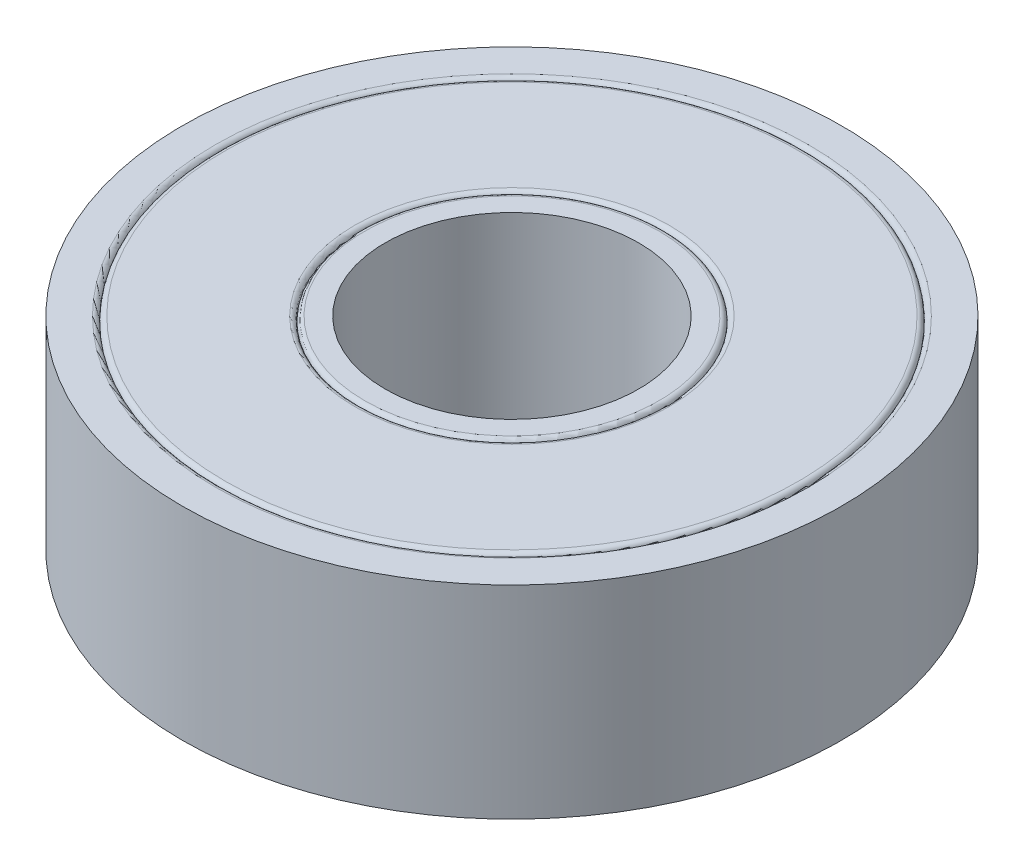
ISO-10303-21;
HEADER;
FILE_DESCRIPTION(('STEP AP214'),'2;1');
FILE_NAME('part.step','',(''),(''),'','','');
FILE_SCHEMA(('AUTOMOTIVE_DESIGN { 1 0 10303 214 1 1 1 1 }'));
ENDSEC;
DATA;
#1=APPLICATION_CONTEXT('core data for automotive mechanical design processes');
#2=APPLICATION_PROTOCOL_DEFINITION('international standard','automotive_design',2000,#1);
#3=PRODUCT_CONTEXT('',#1,'mechanical');
#4=PRODUCT('Part','Part','',(#3));
#5=PRODUCT_RELATED_PRODUCT_CATEGORY('part','',(#4));
#6=PRODUCT_DEFINITION_FORMATION('','',#4);
#7=PRODUCT_DEFINITION_CONTEXT('part definition',#1,'design');
#8=PRODUCT_DEFINITION('design','',#6,#7);
#9=PRODUCT_DEFINITION_SHAPE('','',#8);
#10=(LENGTH_UNIT() NAMED_UNIT(*) SI_UNIT(.MILLI.,.METRE.));
#11=(NAMED_UNIT(*) PLANE_ANGLE_UNIT() SI_UNIT($,.RADIAN.));
#12=(NAMED_UNIT(*) SI_UNIT($,.STERADIAN.) SOLID_ANGLE_UNIT());
#13=UNCERTAINTY_MEASURE_WITH_UNIT(LENGTH_MEASURE(1.E-05),#10,'distance_accuracy_value','');
#14=(GEOMETRIC_REPRESENTATION_CONTEXT(3) GLOBAL_UNCERTAINTY_ASSIGNED_CONTEXT((#13)) GLOBAL_UNIT_ASSIGNED_CONTEXT((#10,
#11,#12)) REPRESENTATION_CONTEXT('',''));
#15=CARTESIAN_POINT('',(0.,0.,0.));
#16=DIRECTION('',(0.,0.,1.));
#17=DIRECTION('',(1.,0.,0.));
#18=AXIS2_PLACEMENT_3D('',#15,#16,#17);
#19=CARTESIAN_POINT('',(-6.70288887729105,-2.,-5.62439158475723));
#20=DIRECTION('',(0.,1.,0.));
#21=DIRECTION('',(0.,0.,1.));
#22=AXIS2_PLACEMENT_3D('',#19,#20,#21);
#23=CYLINDRICAL_SURFACE('',#22,2.75);
#24=CARTESIAN_POINT('',(-6.70288887729105,7.,-5.62439158475723));
#25=DIRECTION('',(0.,1.,0.));
#26=DIRECTION('',(0.,0.,1.));
#27=AXIS2_PLACEMENT_3D('',#24,#25,#26);
#28=CIRCLE('',#27,2.75);
#29=CARTESIAN_POINT('',(-6.70288887729105,7.,-2.87439158475723));
#30=VERTEX_POINT('',#29);
#31=EDGE_CURVE('E243',#30,#30,#28,.F.);
#32=ORIENTED_EDGE('',*,*,#31,.T.);
#33=EDGE_LOOP('',(#32));
#34=FACE_BOUND('',#33,.T.);
#35=CARTESIAN_POINT('',(-6.70288887729105,1.,-5.62439158475723));
#36=DIRECTION('',(0.,-1.,0.));
#37=DIRECTION('',(0.,0.,-1.));
#38=AXIS2_PLACEMENT_3D('',#35,#36,#37);
#39=CIRCLE('',#38,2.75);
#40=CARTESIAN_POINT('',(-6.70288887729105,1.,-8.37439158475723));
#41=VERTEX_POINT('',#40);
#42=EDGE_CURVE('E12',#41,#41,#39,.F.);
#43=ORIENTED_EDGE('',*,*,#42,.T.);
#44=EDGE_LOOP('',(#43));
#45=FACE_BOUND('',#44,.T.);
#46=ADVANCED_FACE('F237',(#34,#45),#23,.T.);
#47=CARTESIAN_POINT('',(0.,7.,0.));
#48=DIRECTION('',(0.,1.,0.));
#49=DIRECTION('',(0.,0.,1.));
#50=AXIS2_PLACEMENT_3D('',#47,#48,#49);
#51=PLANE('',#50);
#52=ORIENTED_EDGE('',*,*,#31,.F.);
#53=EDGE_LOOP('',(#52));
#54=FACE_BOUND('',#53,.T.);
#55=ADVANCED_FACE('F250',(#54),#51,.T.);
#56=CARTESIAN_POINT('',(0.,1.,0.));
#57=DIRECTION('',(0.,-1.,0.));
#58=DIRECTION('',(0.,0.,-1.));
#59=AXIS2_PLACEMENT_3D('',#56,#57,#58);
#60=PLANE('',#59);
#61=ORIENTED_EDGE('',*,*,#42,.F.);
#62=EDGE_LOOP('',(#61));
#63=FACE_BOUND('',#62,.T.);
#64=ADVANCED_FACE('F252',(#63),#60,.T.);
#65=CLOSED_SHELL('',(#46,#55,#64));
#66=MANIFOLD_SOLID_BREP('B2',#65);
#67=CARTESIAN_POINT('',(0.,8.,0.));
#68=DIRECTION('',(0.,-1.,0.));
#69=DIRECTION('',(0.,0.,-1.));
#70=AXIS2_PLACEMENT_3D('',#67,#68,#69);
#71=CYLINDRICAL_SURFACE('',#70,13.);
#72=CARTESIAN_POINT('',(0.,8.,0.));
#73=DIRECTION('',(0.,1.,0.));
#74=DIRECTION('',(0.,0.,1.));
#75=AXIS2_PLACEMENT_3D('',#72,#73,#74);
#76=CIRCLE('',#75,13.);
#77=CARTESIAN_POINT('',(0.,8.,13.));
#78=VERTEX_POINT('',#77);
#79=EDGE_CURVE('E337',#78,#78,#76,.T.);
#80=ORIENTED_EDGE('',*,*,#79,.F.);
#81=EDGE_LOOP('',(#80));
#82=FACE_BOUND('',#81,.T.);
#83=CARTESIAN_POINT('',(0.,0.,0.));
#84=DIRECTION('',(0.,1.,0.));
#85=DIRECTION('',(0.,0.,1.));
#86=AXIS2_PLACEMENT_3D('',#83,#84,#85);
#87=CIRCLE('',#86,13.);
#88=CARTESIAN_POINT('',(0.,0.,13.));
#89=VERTEX_POINT('',#88);
#90=EDGE_CURVE('E340',#89,#89,#87,.T.);
#91=ORIENTED_EDGE('',*,*,#90,.T.);
#92=EDGE_LOOP('',(#91));
#93=FACE_BOUND('',#92,.T.);
#94=ADVANCED_FACE('F289',(#82,#93),#71,.T.);
#95=CARTESIAN_POINT('',(0.,0.,0.));
#96=DIRECTION('',(0.,1.,0.));
#97=DIRECTION('',(0.,0.,1.));
#98=AXIS2_PLACEMENT_3D('',#95,#96,#97);
#99=PLANE('',#98);
#100=CARTESIAN_POINT('',(0.,0.,0.));
#101=DIRECTION('',(0.,1.,0.));
#102=DIRECTION('',(0.,0.,1.));
#103=AXIS2_PLACEMENT_3D('',#100,#101,#102);
#104=CIRCLE('',#103,11.7);
#105=CARTESIAN_POINT('',(0.,0.,11.7));
#106=VERTEX_POINT('',#105);
#107=EDGE_CURVE('E316',#106,#106,#104,.T.);
#108=ORIENTED_EDGE('',*,*,#107,.T.);
#109=EDGE_LOOP('',(#108));
#110=FACE_BOUND('',#109,.T.);
#111=ORIENTED_EDGE('',*,*,#90,.F.);
#112=EDGE_LOOP('',(#111));
#113=FACE_BOUND('',#112,.T.);
#114=ADVANCED_FACE('F390',(#110,#113),#99,.F.);
#115=CARTESIAN_POINT('',(0.,8.,0.));
#116=DIRECTION('',(0.,1.,0.));
#117=DIRECTION('',(0.,0.,1.));
#118=AXIS2_PLACEMENT_3D('',#115,#116,#117);
#119=PLANE('',#118);
#120=CARTESIAN_POINT('',(0.,8.,0.));
#121=DIRECTION('',(0.,1.,0.));
#122=DIRECTION('',(0.,0.,1.));
#123=AXIS2_PLACEMENT_3D('',#120,#121,#122);
#124=CIRCLE('',#123,11.7);
#125=CARTESIAN_POINT('',(0.,8.,11.7));
#126=VERTEX_POINT('',#125);
#127=EDGE_CURVE('E331',#126,#126,#124,.F.);
#128=ORIENTED_EDGE('',*,*,#127,.T.);
#129=EDGE_LOOP('',(#128));
#130=FACE_BOUND('',#129,.T.);
#131=ORIENTED_EDGE('',*,*,#79,.T.);
#132=EDGE_LOOP('',(#131));
#133=FACE_BOUND('',#132,.T.);
#134=ADVANCED_FACE('F393',(#130,#133),#119,.T.);
#135=CARTESIAN_POINT('',(0.,7.8,0.));
#136=DIRECTION('',(0.,1.,0.));
#137=DIRECTION('',(0.,0.,1.));
#138=AXIS2_PLACEMENT_3D('',#135,#136,#137);
#139=TOROIDAL_SURFACE('',#138,11.7,0.2);
#140=ORIENTED_EDGE('',*,*,#127,.F.);
#141=EDGE_LOOP('',(#140));
#142=FACE_BOUND('',#141,.T.);
#143=CARTESIAN_POINT('',(0.,7.8,0.));
#144=DIRECTION('',(0.,1.,0.));
#145=DIRECTION('',(0.,0.,1.));
#146=AXIS2_PLACEMENT_3D('',#143,#144,#145);
#147=CIRCLE('',#146,11.5);
#148=CARTESIAN_POINT('',(0.,7.8,11.5));
#149=VERTEX_POINT('',#148);
#150=EDGE_CURVE('E334',#149,#149,#147,.T.);
#151=ORIENTED_EDGE('',*,*,#150,.F.);
#152=EDGE_LOOP('',(#151));
#153=FACE_BOUND('',#152,.T.);
#154=ADVANCED_FACE('F397',(#142,#153),#139,.T.);
#155=CARTESIAN_POINT('',(0.,8.,0.));
#156=DIRECTION('',(0.,1.,0.));
#157=DIRECTION('',(0.,0.,1.));
#158=AXIS2_PLACEMENT_3D('',#155,#156,#157);
#159=PLANE('',#158);
#160=CARTESIAN_POINT('',(0.,8.,0.));
#161=DIRECTION('',(0.,1.,0.));
#162=DIRECTION('',(0.,0.,1.));
#163=AXIS2_PLACEMENT_3D('',#160,#161,#162);
#164=CIRCLE('',#163,11.3);
#165=CARTESIAN_POINT('',(0.,8.,11.3));
#166=VERTEX_POINT('',#165);
#167=EDGE_CURVE('E236',#166,#166,#164,.T.);
#168=ORIENTED_EDGE('',*,*,#167,.T.);
#169=EDGE_LOOP('',(#168));
#170=FACE_BOUND('',#169,.T.);
#171=CARTESIAN_POINT('',(0.,8.,0.));
#172=DIRECTION('',(0.,1.,0.));
#173=DIRECTION('',(0.,0.,1.));
#174=AXIS2_PLACEMENT_3D('',#171,#172,#173);
#175=CIRCLE('',#174,6.2);
#176=CARTESIAN_POINT('',(0.,8.,6.2));
#177=VERTEX_POINT('',#176);
#178=EDGE_CURVE('E297',#177,#177,#175,.F.);
#179=ORIENTED_EDGE('',*,*,#178,.T.);
#180=EDGE_LOOP('',(#179));
#181=FACE_BOUND('',#180,.T.);
#182=ADVANCED_FACE('F401',(#170,#181),#159,.T.);
#183=CARTESIAN_POINT('',(0.,8.,0.));
#184=DIRECTION('',(0.,1.,0.));
#185=DIRECTION('',(0.,0.,1.));
#186=AXIS2_PLACEMENT_3D('',#183,#184,#185);
#187=PLANE('',#186);
#188=CARTESIAN_POINT('',(0.,8.,0.));
#189=DIRECTION('',(0.,1.,0.));
#190=DIRECTION('',(0.,0.,1.));
#191=AXIS2_PLACEMENT_3D('',#188,#189,#190);
#192=CIRCLE('',#191,5.8);
#193=CARTESIAN_POINT('',(0.,8.,5.8));
#194=VERTEX_POINT('',#193);
#195=EDGE_CURVE('E346',#194,#194,#192,.T.);
#196=ORIENTED_EDGE('',*,*,#195,.T.);
#197=EDGE_LOOP('',(#196));
#198=FACE_BOUND('',#197,.T.);
#199=CARTESIAN_POINT('',(0.,8.,0.));
#200=DIRECTION('',(0.,1.,0.));
#201=DIRECTION('',(0.,0.,1.));
#202=AXIS2_PLACEMENT_3D('',#199,#200,#201);
#203=CIRCLE('',#202,5.);
#204=CARTESIAN_POINT('',(0.,8.,5.));
#205=VERTEX_POINT('',#204);
#206=EDGE_CURVE('E349',#205,#205,#203,.T.);
#207=ORIENTED_EDGE('',*,*,#206,.F.);
#208=EDGE_LOOP('',(#207));
#209=FACE_BOUND('',#208,.T.);
#210=ADVANCED_FACE('F457',(#198,#209),#187,.T.);
#211=CARTESIAN_POINT('',(0.,0.,0.));
#212=DIRECTION('',(0.,1.,0.));
#213=DIRECTION('',(0.,0.,1.));
#214=AXIS2_PLACEMENT_3D('',#211,#212,#213);
#215=PLANE('',#214);
#216=CARTESIAN_POINT('',(0.,0.,0.));
#217=DIRECTION('',(0.,1.,0.));
#218=DIRECTION('',(0.,0.,1.));
#219=AXIS2_PLACEMENT_3D('',#216,#217,#218);
#220=CIRCLE('',#219,5.8);
#221=CARTESIAN_POINT('',(0.,0.,5.8));
#222=VERTEX_POINT('',#221);
#223=EDGE_CURVE('E319',#222,#222,#220,.F.);
#224=ORIENTED_EDGE('',*,*,#223,.T.);
#225=EDGE_LOOP('',(#224));
#226=FACE_BOUND('',#225,.T.);
#227=CARTESIAN_POINT('',(0.,0.,0.));
#228=DIRECTION('',(0.,1.,0.));
#229=DIRECTION('',(0.,0.,1.));
#230=AXIS2_PLACEMENT_3D('',#227,#228,#229);
#231=CIRCLE('',#230,5.);
#232=CARTESIAN_POINT('',(0.,0.,5.));
#233=VERTEX_POINT('',#232);
#234=EDGE_CURVE('E352',#233,#233,#231,.T.);
#235=ORIENTED_EDGE('',*,*,#234,.T.);
#236=EDGE_LOOP('',(#235));
#237=FACE_BOUND('',#236,.T.);
#238=ADVANCED_FACE('F464',(#226,#237),#215,.F.);
#239=CARTESIAN_POINT('',(0.,8.,0.));
#240=DIRECTION('',(0.,-1.,0.));
#241=DIRECTION('',(0.,0.,-1.));
#242=AXIS2_PLACEMENT_3D('',#239,#240,#241);
#243=CYLINDRICAL_SURFACE('',#242,5.);
#244=ORIENTED_EDGE('',*,*,#206,.T.);
#245=EDGE_LOOP('',(#244));
#246=FACE_BOUND('',#245,.T.);
#247=ORIENTED_EDGE('',*,*,#234,.F.);
#248=EDGE_LOOP('',(#247));
#249=FACE_BOUND('',#248,.T.);
#250=ADVANCED_FACE('F473',(#246,#249),#243,.F.);
#251=CARTESIAN_POINT('',(0.,7.8,0.));
#252=DIRECTION('',(0.,1.,0.));
#253=DIRECTION('',(0.,0.,1.));
#254=AXIS2_PLACEMENT_3D('',#251,#252,#253);
#255=TOROIDAL_SURFACE('',#254,5.8,0.2);
#256=CARTESIAN_POINT('',(0.,7.8,0.));
#257=DIRECTION('',(0.,1.,0.));
#258=DIRECTION('',(0.,0.,1.));
#259=AXIS2_PLACEMENT_3D('',#256,#257,#258);
#260=CIRCLE('',#259,6.);
#261=CARTESIAN_POINT('',(0.,7.8,6.));
#262=VERTEX_POINT('',#261);
#263=EDGE_CURVE('E325',#262,#262,#260,.T.);
#264=ORIENTED_EDGE('',*,*,#263,.T.);
#265=EDGE_LOOP('',(#264));
#266=FACE_BOUND('',#265,.T.);
#267=ORIENTED_EDGE('',*,*,#195,.F.);
#268=EDGE_LOOP('',(#267));
#269=FACE_BOUND('',#268,.T.);
#270=ADVANCED_FACE('F407',(#266,#269),#255,.T.);
#271=CARTESIAN_POINT('',(0.,0.2,0.));
#272=DIRECTION('',(0.,1.,0.));
#273=DIRECTION('',(0.,0.,1.));
#274=AXIS2_PLACEMENT_3D('',#271,#272,#273);
#275=TOROIDAL_SURFACE('',#274,5.8,0.2);
#276=ORIENTED_EDGE('',*,*,#223,.F.);
#277=EDGE_LOOP('',(#276));
#278=FACE_BOUND('',#277,.T.);
#279=CARTESIAN_POINT('',(0.,0.2,0.));
#280=DIRECTION('',(0.,1.,0.));
#281=DIRECTION('',(0.,0.,1.));
#282=AXIS2_PLACEMENT_3D('',#279,#280,#281);
#283=CIRCLE('',#282,6.);
#284=CARTESIAN_POINT('',(0.,0.2,6.));
#285=VERTEX_POINT('',#284);
#286=EDGE_CURVE('E322',#285,#285,#283,.T.);
#287=ORIENTED_EDGE('',*,*,#286,.F.);
#288=EDGE_LOOP('',(#287));
#289=FACE_BOUND('',#288,.T.);
#290=ADVANCED_FACE('F403',(#278,#289),#275,.T.);
#291=CARTESIAN_POINT('',(0.,0.2,0.));
#292=DIRECTION('',(0.,1.,0.));
#293=DIRECTION('',(0.,0.,1.));
#294=AXIS2_PLACEMENT_3D('',#291,#292,#293);
#295=TOROIDAL_SURFACE('',#294,11.7,0.2);
#296=CARTESIAN_POINT('',(0.,0.2,0.));
#297=DIRECTION('',(0.,1.,0.));
#298=DIRECTION('',(0.,0.,1.));
#299=AXIS2_PLACEMENT_3D('',#296,#297,#298);
#300=CIRCLE('',#299,11.5);
#301=CARTESIAN_POINT('',(0.,0.2,11.5));
#302=VERTEX_POINT('',#301);
#303=EDGE_CURVE('E313',#302,#302,#300,.F.);
#304=ORIENTED_EDGE('',*,*,#303,.F.);
#305=EDGE_LOOP('',(#304));
#306=FACE_BOUND('',#305,.T.);
#307=ORIENTED_EDGE('',*,*,#107,.F.);
#308=EDGE_LOOP('',(#307));
#309=FACE_BOUND('',#308,.T.);
#310=ADVANCED_FACE('F406',(#306,#309),#295,.T.);
#311=CARTESIAN_POINT('',(0.,0.,0.));
#312=DIRECTION('',(0.,-1.,0.));
#313=DIRECTION('',(0.,0.,-1.));
#314=AXIS2_PLACEMENT_3D('',#311,#312,#313);
#315=PLANE('',#314);
#316=CARTESIAN_POINT('',(0.,0.,0.));
#317=DIRECTION('',(0.,-1.,0.));
#318=DIRECTION('',(0.,0.,-1.));
#319=AXIS2_PLACEMENT_3D('',#316,#317,#318);
#320=CIRCLE('',#319,6.2);
#321=CARTESIAN_POINT('',(0.,0.,-6.2));
#322=VERTEX_POINT('',#321);
#323=EDGE_CURVE('E301',#322,#322,#320,.F.);
#324=ORIENTED_EDGE('',*,*,#323,.T.);
#325=EDGE_LOOP('',(#324));
#326=FACE_BOUND('',#325,.T.);
#327=CARTESIAN_POINT('',(0.,0.,0.));
#328=DIRECTION('',(0.,-1.,0.));
#329=DIRECTION('',(0.,0.,-1.));
#330=AXIS2_PLACEMENT_3D('',#327,#328,#329);
#331=CIRCLE('',#330,11.3);
#332=CARTESIAN_POINT('',(0.,0.,-11.3));
#333=VERTEX_POINT('',#332);
#334=EDGE_CURVE('E305',#333,#333,#331,.T.);
#335=ORIENTED_EDGE('',*,*,#334,.T.);
#336=EDGE_LOOP('',(#335));
#337=FACE_BOUND('',#336,.T.);
#338=ADVANCED_FACE('F411',(#326,#337),#315,.T.);
#339=CARTESIAN_POINT('',(0.,0.2,0.));
#340=DIRECTION('',(0.,-1.,0.));
#341=DIRECTION('',(0.,0.,-1.));
#342=AXIS2_PLACEMENT_3D('',#339,#340,#341);
#343=TOROIDAL_SURFACE('',#342,11.3,0.2);
#344=ORIENTED_EDGE('',*,*,#303,.T.);
#345=EDGE_LOOP('',(#344));
#346=FACE_BOUND('',#345,.T.);
#347=ORIENTED_EDGE('',*,*,#334,.F.);
#348=EDGE_LOOP('',(#347));
#349=FACE_BOUND('',#348,.T.);
#350=ADVANCED_FACE('F413',(#346,#349),#343,.T.);
#351=CARTESIAN_POINT('',(0.,0.2,0.));
#352=DIRECTION('',(0.,-1.,0.));
#353=DIRECTION('',(0.,0.,-1.));
#354=AXIS2_PLACEMENT_3D('',#351,#352,#353);
#355=TOROIDAL_SURFACE('',#354,6.2,0.2);
#356=ORIENTED_EDGE('',*,*,#323,.F.);
#357=EDGE_LOOP('',(#356));
#358=FACE_BOUND('',#357,.T.);
#359=ORIENTED_EDGE('',*,*,#286,.T.);
#360=EDGE_LOOP('',(#359));
#361=FACE_BOUND('',#360,.T.);
#362=ADVANCED_FACE('F416',(#358,#361),#355,.T.);
#363=CARTESIAN_POINT('',(0.,7.8,0.));
#364=DIRECTION('',(0.,1.,0.));
#365=DIRECTION('',(0.,0.,1.));
#366=AXIS2_PLACEMENT_3D('',#363,#364,#365);
#367=TOROIDAL_SURFACE('',#366,6.2,0.2);
#368=ORIENTED_EDGE('',*,*,#178,.F.);
#369=EDGE_LOOP('',(#368));
#370=FACE_BOUND('',#369,.T.);
#371=ORIENTED_EDGE('',*,*,#263,.F.);
#372=EDGE_LOOP('',(#371));
#373=FACE_BOUND('',#372,.T.);
#374=ADVANCED_FACE('F419',(#370,#373),#367,.T.);
#375=CARTESIAN_POINT('',(0.,7.8,0.));
#376=DIRECTION('',(0.,1.,0.));
#377=DIRECTION('',(0.,0.,1.));
#378=AXIS2_PLACEMENT_3D('',#375,#376,#377);
#379=TOROIDAL_SURFACE('',#378,11.3,0.2);
#380=ORIENTED_EDGE('',*,*,#150,.T.);
#381=EDGE_LOOP('',(#380));
#382=FACE_BOUND('',#381,.T.);
#383=ORIENTED_EDGE('',*,*,#167,.F.);
#384=EDGE_LOOP('',(#383));
#385=FACE_BOUND('',#384,.T.);
#386=ADVANCED_FACE('F291',(#382,#385),#379,.T.);
#387=CLOSED_SHELL('',(#94,#114,#134,#154,#182,#210,#238,#250,#270,#290,#310,#338,#350,#362,#374,#386));
#388=CARTESIAN_POINT('',(0.,-2.,0.));
#389=DIRECTION('',(0.,1.,0.));
#390=DIRECTION('',(0.,0.,1.));
#391=AXIS2_PLACEMENT_3D('',#388,#389,#390);
#392=CYLINDRICAL_SURFACE('',#391,11.5);
#393=CARTESIAN_POINT('',(0.,7.5,0.));
#394=DIRECTION('',(0.,1.,0.));
#395=DIRECTION('',(0.,0.,1.));
#396=AXIS2_PLACEMENT_3D('',#393,#394,#395);
#397=CIRCLE('',#396,11.5);
#398=CARTESIAN_POINT('',(0.,7.5,11.5));
#399=VERTEX_POINT('',#398);
#400=EDGE_CURVE('E328',#399,#399,#397,.F.);
#401=ORIENTED_EDGE('',*,*,#400,.F.);
#402=EDGE_LOOP('',(#401));
#403=FACE_BOUND('',#402,.T.);
#404=CARTESIAN_POINT('',(0.,0.5,0.));
#405=DIRECTION('',(0.,-1.,0.));
#406=DIRECTION('',(0.,0.,-1.));
#407=AXIS2_PLACEMENT_3D('',#404,#405,#406);
#408=CIRCLE('',#407,11.5);
#409=CARTESIAN_POINT('',(0.,0.5,-11.5));
#410=VERTEX_POINT('',#409);
#411=EDGE_CURVE('E310',#410,#410,#408,.F.);
#412=ORIENTED_EDGE('',*,*,#411,.F.);
#413=EDGE_LOOP('',(#412));
#414=FACE_BOUND('',#413,.T.);
#415=ADVANCED_FACE('F373',(#403,#414),#392,.F.);
#416=CARTESIAN_POINT('',(0.,7.5,0.));
#417=DIRECTION('',(0.,1.,0.));
#418=DIRECTION('',(0.,0.,1.));
#419=AXIS2_PLACEMENT_3D('',#416,#417,#418);
#420=PLANE('',#419);
#421=CARTESIAN_POINT('',(0.,7.5,0.));
#422=DIRECTION('',(0.,1.,0.));
#423=DIRECTION('',(0.,0.,1.));
#424=AXIS2_PLACEMENT_3D('',#421,#422,#423);
#425=CIRCLE('',#424,6.);
#426=CARTESIAN_POINT('',(0.,7.5,6.));
#427=VERTEX_POINT('',#426);
#428=EDGE_CURVE('E343',#427,#427,#425,.T.);
#429=ORIENTED_EDGE('',*,*,#428,.T.);
#430=EDGE_LOOP('',(#429));
#431=FACE_BOUND('',#430,.T.);
#432=ORIENTED_EDGE('',*,*,#400,.T.);
#433=EDGE_LOOP('',(#432));
#434=FACE_BOUND('',#433,.T.);
#435=ADVANCED_FACE('F364',(#431,#434),#420,.F.);
#436=CARTESIAN_POINT('',(0.,-2.,0.));
#437=DIRECTION('',(0.,1.,0.));
#438=DIRECTION('',(0.,0.,1.));
#439=AXIS2_PLACEMENT_3D('',#436,#437,#438);
#440=CYLINDRICAL_SURFACE('',#439,6.);
#441=ORIENTED_EDGE('',*,*,#428,.F.);
#442=EDGE_LOOP('',(#441));
#443=FACE_BOUND('',#442,.T.);
#444=CARTESIAN_POINT('',(0.,0.5,0.));
#445=DIRECTION('',(0.,-1.,0.));
#446=DIRECTION('',(0.,0.,-1.));
#447=AXIS2_PLACEMENT_3D('',#444,#445,#446);
#448=CIRCLE('',#447,6.);
#449=CARTESIAN_POINT('',(0.,0.5,-6.));
#450=VERTEX_POINT('',#449);
#451=EDGE_CURVE('E355',#450,#450,#448,.T.);
#452=ORIENTED_EDGE('',*,*,#451,.F.);
#453=EDGE_LOOP('',(#452));
#454=FACE_BOUND('',#453,.T.);
#455=ADVANCED_FACE('F362',(#443,#454),#440,.T.);
#456=CARTESIAN_POINT('',(0.,0.5,0.));
#457=DIRECTION('',(0.,-1.,0.));
#458=DIRECTION('',(0.,0.,-1.));
#459=AXIS2_PLACEMENT_3D('',#456,#457,#458);
#460=PLANE('',#459);
#461=ORIENTED_EDGE('',*,*,#451,.T.);
#462=EDGE_LOOP('',(#461));
#463=FACE_BOUND('',#462,.T.);
#464=ORIENTED_EDGE('',*,*,#411,.T.);
#465=EDGE_LOOP('',(#464));
#466=FACE_BOUND('',#465,.T.);
#467=ADVANCED_FACE('F359',(#463,#466),#460,.F.);
#468=CLOSED_SHELL('',(#415,#435,#455,#467));
#469=ORIENTED_CLOSED_SHELL('',*,#468,.T.);
#470=BREP_WITH_VOIDS('B7',#387,(#469));
#471=CARTESIAN_POINT('',(-8.75,-2.,0.));
#472=DIRECTION('',(0.,1.,0.));
#473=DIRECTION('',(0.,0.,1.));
#474=AXIS2_PLACEMENT_3D('',#471,#472,#473);
#475=CYLINDRICAL_SURFACE('',#474,2.75);
#476=CARTESIAN_POINT('',(-8.75,7.,0.));
#477=DIRECTION('',(0.,1.,0.));
#478=DIRECTION('',(0.,0.,1.));
#479=AXIS2_PLACEMENT_3D('',#476,#477,#478);
#480=CIRCLE('',#479,2.75);
#481=CARTESIAN_POINT('',(-8.75,7.,2.75));
#482=VERTEX_POINT('',#481);
#483=EDGE_CURVE('E670',#482,#482,#480,.F.);
#484=ORIENTED_EDGE('',*,*,#483,.T.);
#485=EDGE_LOOP('',(#484));
#486=FACE_BOUND('',#485,.T.);
#487=CARTESIAN_POINT('',(-8.75,1.,0.));
#488=DIRECTION('',(0.,-1.,0.));
#489=DIRECTION('',(0.,0.,-1.));
#490=AXIS2_PLACEMENT_3D('',#487,#488,#489);
#491=CIRCLE('',#490,2.75);
#492=CARTESIAN_POINT('',(-8.75,1.,-2.75));
#493=VERTEX_POINT('',#492);
#494=EDGE_CURVE('E287',#493,#493,#491,.F.);
#495=ORIENTED_EDGE('',*,*,#494,.T.);
#496=EDGE_LOOP('',(#495));
#497=FACE_BOUND('',#496,.T.);
#498=ADVANCED_FACE('F664',(#486,#497),#475,.T.);
#499=CARTESIAN_POINT('',(0.,7.,0.));
#500=DIRECTION('',(0.,1.,0.));
#501=DIRECTION('',(0.,0.,1.));
#502=AXIS2_PLACEMENT_3D('',#499,#500,#501);
#503=PLANE('',#502);
#504=ORIENTED_EDGE('',*,*,#483,.F.);
#505=EDGE_LOOP('',(#504));
#506=FACE_BOUND('',#505,.T.);
#507=ADVANCED_FACE('F677',(#506),#503,.T.);
#508=CARTESIAN_POINT('',(0.,1.,0.));
#509=DIRECTION('',(0.,-1.,0.));
#510=DIRECTION('',(0.,0.,-1.));
#511=AXIS2_PLACEMENT_3D('',#508,#509,#510);
#512=PLANE('',#511);
#513=ORIENTED_EDGE('',*,*,#494,.F.);
#514=EDGE_LOOP('',(#513));
#515=FACE_BOUND('',#514,.T.);
#516=ADVANCED_FACE('F679',(#515),#512,.T.);
#517=CLOSED_SHELL('',(#498,#507,#516));
#518=MANIFOLD_SOLID_BREP('B231',#517);
#519=CARTESIAN_POINT('',(-1.51942155458562,-2.,-8.61706783885682));
#520=DIRECTION('',(0.,1.,0.));
#521=DIRECTION('',(0.,0.,1.));
#522=AXIS2_PLACEMENT_3D('',#519,#520,#521);
#523=CYLINDRICAL_SURFACE('',#522,2.75);
#524=CARTESIAN_POINT('',(-1.51942155458562,7.,-8.61706783885682));
#525=DIRECTION('',(0.,1.,0.));
#526=DIRECTION('',(0.,0.,1.));
#527=AXIS2_PLACEMENT_3D('',#524,#525,#526);
#528=CIRCLE('',#527,2.75);
#529=CARTESIAN_POINT('',(-1.51942155458562,7.,-5.86706783885683));
#530=VERTEX_POINT('',#529);
#531=EDGE_CURVE('E721',#530,#530,#528,.F.);
#532=ORIENTED_EDGE('',*,*,#531,.T.);
#533=EDGE_LOOP('',(#532));
#534=FACE_BOUND('',#533,.T.);
#535=CARTESIAN_POINT('',(-1.51942155458562,1.,-8.61706783885682));
#536=DIRECTION('',(0.,-1.,0.));
#537=DIRECTION('',(0.,0.,-1.));
#538=AXIS2_PLACEMENT_3D('',#535,#536,#537);
#539=CIRCLE('',#538,2.75);
#540=CARTESIAN_POINT('',(-1.51942155458562,1.,-11.3670678388568));
#541=VERTEX_POINT('',#540);
#542=EDGE_CURVE('E663',#541,#541,#539,.F.);
#543=ORIENTED_EDGE('',*,*,#542,.T.);
#544=EDGE_LOOP('',(#543));
#545=FACE_BOUND('',#544,.T.);
#546=ADVANCED_FACE('F715',(#534,#545),#523,.T.);
#547=CARTESIAN_POINT('',(0.,7.,0.));
#548=DIRECTION('',(0.,1.,0.));
#549=DIRECTION('',(0.,0.,1.));
#550=AXIS2_PLACEMENT_3D('',#547,#548,#549);
#551=PLANE('',#550);
#552=ORIENTED_EDGE('',*,*,#531,.F.);
#553=EDGE_LOOP('',(#552));
#554=FACE_BOUND('',#553,.T.);
#555=ADVANCED_FACE('F728',(#554),#551,.T.);
#556=CARTESIAN_POINT('',(0.,1.,0.));
#557=DIRECTION('',(0.,-1.,0.));
#558=DIRECTION('',(0.,0.,-1.));
#559=AXIS2_PLACEMENT_3D('',#556,#557,#558);
#560=PLANE('',#559);
#561=ORIENTED_EDGE('',*,*,#542,.F.);
#562=EDGE_LOOP('',(#561));
#563=FACE_BOUND('',#562,.T.);
#564=ADVANCED_FACE('F730',(#563),#560,.T.);
#565=CLOSED_SHELL('',(#546,#555,#564));
#566=MANIFOLD_SOLID_BREP('B282',#565);
#567=CARTESIAN_POINT('',(8.22231043187672,-2.,-2.99267625409955));
#568=DIRECTION('',(0.,1.,0.));
#569=DIRECTION('',(0.,0.,1.));
#570=AXIS2_PLACEMENT_3D('',#567,#568,#569);
#571=CYLINDRICAL_SURFACE('',#570,2.75);
#572=CARTESIAN_POINT('',(8.22231043187672,7.,-2.99267625409955));
#573=DIRECTION('',(0.,1.,0.));
#574=DIRECTION('',(0.,0.,1.));
#575=AXIS2_PLACEMENT_3D('',#572,#573,#574);
#576=CIRCLE('',#575,2.75);
#577=CARTESIAN_POINT('',(8.22231043187672,7.,-0.242676254099553));
#578=VERTEX_POINT('',#577);
#579=EDGE_CURVE('E772',#578,#578,#576,.F.);
#580=ORIENTED_EDGE('',*,*,#579,.T.);
#581=EDGE_LOOP('',(#580));
#582=FACE_BOUND('',#581,.T.);
#583=CARTESIAN_POINT('',(8.22231043187672,1.,-2.99267625409955));
#584=DIRECTION('',(0.,-1.,0.));
#585=DIRECTION('',(0.,0.,-1.));
#586=AXIS2_PLACEMENT_3D('',#583,#584,#585);
#587=CIRCLE('',#586,2.75);
#588=CARTESIAN_POINT('',(8.22231043187672,1.,-5.74267625409955));
#589=VERTEX_POINT('',#588);
#590=EDGE_CURVE('E714',#589,#589,#587,.F.);
#591=ORIENTED_EDGE('',*,*,#590,.T.);
#592=EDGE_LOOP('',(#591));
#593=FACE_BOUND('',#592,.T.);
#594=ADVANCED_FACE('F766',(#582,#593),#571,.T.);
#595=CARTESIAN_POINT('',(0.,7.,0.));
#596=DIRECTION('',(0.,1.,0.));
#597=DIRECTION('',(0.,0.,1.));
#598=AXIS2_PLACEMENT_3D('',#595,#596,#597);
#599=PLANE('',#598);
#600=ORIENTED_EDGE('',*,*,#579,.F.);
#601=EDGE_LOOP('',(#600));
#602=FACE_BOUND('',#601,.T.);
#603=ADVANCED_FACE('F779',(#602),#599,.T.);
#604=CARTESIAN_POINT('',(0.,1.,0.));
#605=DIRECTION('',(0.,-1.,0.));
#606=DIRECTION('',(0.,0.,-1.));
#607=AXIS2_PLACEMENT_3D('',#604,#605,#606);
#608=PLANE('',#607);
#609=ORIENTED_EDGE('',*,*,#590,.F.);
#610=EDGE_LOOP('',(#609));
#611=FACE_BOUND('',#610,.T.);
#612=ADVANCED_FACE('F781',(#611),#608,.T.);
#613=CLOSED_SHELL('',(#594,#603,#612));
#614=MANIFOLD_SOLID_BREP('B658',#613);
#615=CARTESIAN_POINT('',(4.37500000000004,-2.,-7.57772228311382));
#616=DIRECTION('',(0.,1.,0.));
#617=DIRECTION('',(0.,0.,1.));
#618=AXIS2_PLACEMENT_3D('',#615,#616,#617);
#619=CYLINDRICAL_SURFACE('',#618,2.75);
#620=CARTESIAN_POINT('',(4.37500000000004,7.,-7.57772228311382));
#621=DIRECTION('',(0.,1.,0.));
#622=DIRECTION('',(0.,0.,1.));
#623=AXIS2_PLACEMENT_3D('',#620,#621,#622);
#624=CIRCLE('',#623,2.75);
#625=CARTESIAN_POINT('',(4.37500000000004,7.,-4.82772228311382));
#626=VERTEX_POINT('',#625);
#627=EDGE_CURVE('E823',#626,#626,#624,.F.);
#628=ORIENTED_EDGE('',*,*,#627,.T.);
#629=EDGE_LOOP('',(#628));
#630=FACE_BOUND('',#629,.T.);
#631=CARTESIAN_POINT('',(4.37500000000004,1.,-7.57772228311382));
#632=DIRECTION('',(0.,-1.,0.));
#633=DIRECTION('',(0.,0.,-1.));
#634=AXIS2_PLACEMENT_3D('',#631,#632,#633);
#635=CIRCLE('',#634,2.75);
#636=CARTESIAN_POINT('',(4.37500000000004,1.,-10.3277222831138));
#637=VERTEX_POINT('',#636);
#638=EDGE_CURVE('E765',#637,#637,#635,.F.);
#639=ORIENTED_EDGE('',*,*,#638,.T.);
#640=EDGE_LOOP('',(#639));
#641=FACE_BOUND('',#640,.T.);
#642=ADVANCED_FACE('F817',(#630,#641),#619,.T.);
#643=CARTESIAN_POINT('',(0.,7.,0.));
#644=DIRECTION('',(0.,1.,0.));
#645=DIRECTION('',(0.,0.,1.));
#646=AXIS2_PLACEMENT_3D('',#643,#644,#645);
#647=PLANE('',#646);
#648=ORIENTED_EDGE('',*,*,#627,.F.);
#649=EDGE_LOOP('',(#648));
#650=FACE_BOUND('',#649,.T.);
#651=ADVANCED_FACE('F830',(#650),#647,.T.);
#652=CARTESIAN_POINT('',(0.,1.,0.));
#653=DIRECTION('',(0.,-1.,0.));
#654=DIRECTION('',(0.,0.,-1.));
#655=AXIS2_PLACEMENT_3D('',#652,#653,#654);
#656=PLANE('',#655);
#657=ORIENTED_EDGE('',*,*,#638,.F.);
#658=EDGE_LOOP('',(#657));
#659=FACE_BOUND('',#658,.T.);
#660=ADVANCED_FACE('F832',(#659),#656,.T.);
#661=CLOSED_SHELL('',(#642,#651,#660));
#662=MANIFOLD_SOLID_BREP('B709',#661);
#663=CARTESIAN_POINT('',(8.22231043187668,-2.,2.99267625409966));
#664=DIRECTION('',(0.,1.,0.));
#665=DIRECTION('',(0.,0.,1.));
#666=AXIS2_PLACEMENT_3D('',#663,#664,#665);
#667=CYLINDRICAL_SURFACE('',#666,2.75);
#668=CARTESIAN_POINT('',(8.22231043187668,7.,2.99267625409966));
#669=DIRECTION('',(0.,1.,0.));
#670=DIRECTION('',(0.,0.,1.));
#671=AXIS2_PLACEMENT_3D('',#668,#669,#670);
#672=CIRCLE('',#671,2.75);
#673=CARTESIAN_POINT('',(8.22231043187668,7.,5.74267625409966));
#674=VERTEX_POINT('',#673);
#675=EDGE_CURVE('E874',#674,#674,#672,.F.);
#676=ORIENTED_EDGE('',*,*,#675,.T.);
#677=EDGE_LOOP('',(#676));
#678=FACE_BOUND('',#677,.T.);
#679=CARTESIAN_POINT('',(8.22231043187668,1.,2.99267625409966));
#680=DIRECTION('',(0.,-1.,0.));
#681=DIRECTION('',(0.,0.,-1.));
#682=AXIS2_PLACEMENT_3D('',#679,#680,#681);
#683=CIRCLE('',#682,2.75);
#684=CARTESIAN_POINT('',(8.22231043187668,1.,0.242676254099665));
#685=VERTEX_POINT('',#684);
#686=EDGE_CURVE('E816',#685,#685,#683,.F.);
#687=ORIENTED_EDGE('',*,*,#686,.T.);
#688=EDGE_LOOP('',(#687));
#689=FACE_BOUND('',#688,.T.);
#690=ADVANCED_FACE('F868',(#678,#689),#667,.T.);
#691=CARTESIAN_POINT('',(0.,7.,0.));
#692=DIRECTION('',(0.,1.,0.));
#693=DIRECTION('',(0.,0.,1.));
#694=AXIS2_PLACEMENT_3D('',#691,#692,#693);
#695=PLANE('',#694);
#696=ORIENTED_EDGE('',*,*,#675,.F.);
#697=EDGE_LOOP('',(#696));
#698=FACE_BOUND('',#697,.T.);
#699=ADVANCED_FACE('F881',(#698),#695,.T.);
#700=CARTESIAN_POINT('',(0.,1.,0.));
#701=DIRECTION('',(0.,-1.,0.));
#702=DIRECTION('',(0.,0.,-1.));
#703=AXIS2_PLACEMENT_3D('',#700,#701,#702);
#704=PLANE('',#703);
#705=ORIENTED_EDGE('',*,*,#686,.F.);
#706=EDGE_LOOP('',(#705));
#707=FACE_BOUND('',#706,.T.);
#708=ADVANCED_FACE('F883',(#707),#704,.T.);
#709=CLOSED_SHELL('',(#690,#699,#708));
#710=MANIFOLD_SOLID_BREP('B760',#709);
#711=CARTESIAN_POINT('',(4.37499999999993,-2.,7.57772228311388));
#712=DIRECTION('',(0.,1.,0.));
#713=DIRECTION('',(0.,0.,1.));
#714=AXIS2_PLACEMENT_3D('',#711,#712,#713);
#715=CYLINDRICAL_SURFACE('',#714,2.75);
#716=CARTESIAN_POINT('',(4.37499999999993,7.,7.57772228311388));
#717=DIRECTION('',(0.,1.,0.));
#718=DIRECTION('',(0.,0.,1.));
#719=AXIS2_PLACEMENT_3D('',#716,#717,#718);
#720=CIRCLE('',#719,2.75);
#721=CARTESIAN_POINT('',(4.37499999999993,7.,10.3277222831139));
#722=VERTEX_POINT('',#721);
#723=EDGE_CURVE('E925',#722,#722,#720,.F.);
#724=ORIENTED_EDGE('',*,*,#723,.T.);
#725=EDGE_LOOP('',(#724));
#726=FACE_BOUND('',#725,.T.);
#727=CARTESIAN_POINT('',(4.37499999999993,1.,7.57772228311388));
#728=DIRECTION('',(0.,-1.,0.));
#729=DIRECTION('',(0.,0.,-1.));
#730=AXIS2_PLACEMENT_3D('',#727,#728,#729);
#731=CIRCLE('',#730,2.75);
#732=CARTESIAN_POINT('',(4.37499999999993,1.,4.82772228311388));
#733=VERTEX_POINT('',#732);
#734=EDGE_CURVE('E867',#733,#733,#731,.F.);
#735=ORIENTED_EDGE('',*,*,#734,.T.);
#736=EDGE_LOOP('',(#735));
#737=FACE_BOUND('',#736,.T.);
#738=ADVANCED_FACE('F919',(#726,#737),#715,.T.);
#739=CARTESIAN_POINT('',(0.,7.,0.));
#740=DIRECTION('',(0.,1.,0.));
#741=DIRECTION('',(0.,0.,1.));
#742=AXIS2_PLACEMENT_3D('',#739,#740,#741);
#743=PLANE('',#742);
#744=ORIENTED_EDGE('',*,*,#723,.F.);
#745=EDGE_LOOP('',(#744));
#746=FACE_BOUND('',#745,.T.);
#747=ADVANCED_FACE('F932',(#746),#743,.T.);
#748=CARTESIAN_POINT('',(0.,1.,0.));
#749=DIRECTION('',(0.,-1.,0.));
#750=DIRECTION('',(0.,0.,-1.));
#751=AXIS2_PLACEMENT_3D('',#748,#749,#750);
#752=PLANE('',#751);
#753=ORIENTED_EDGE('',*,*,#734,.F.);
#754=EDGE_LOOP('',(#753));
#755=FACE_BOUND('',#754,.T.);
#756=ADVANCED_FACE('F934',(#755),#752,.T.);
#757=CLOSED_SHELL('',(#738,#747,#756));
#758=MANIFOLD_SOLID_BREP('B811',#757);
#759=CARTESIAN_POINT('',(-1.51942155458573,-2.,8.61706783885681));
#760=DIRECTION('',(0.,1.,0.));
#761=DIRECTION('',(0.,0.,1.));
#762=AXIS2_PLACEMENT_3D('',#759,#760,#761);
#763=CYLINDRICAL_SURFACE('',#762,2.75);
#764=CARTESIAN_POINT('',(-1.51942155458573,7.,8.61706783885681));
#765=DIRECTION('',(0.,1.,0.));
#766=DIRECTION('',(0.,0.,1.));
#767=AXIS2_PLACEMENT_3D('',#764,#765,#766);
#768=CIRCLE('',#767,2.75);
#769=CARTESIAN_POINT('',(-1.51942155458573,7.,11.3670678388568));
#770=VERTEX_POINT('',#769);
#771=EDGE_CURVE('E975',#770,#770,#768,.F.);
#772=ORIENTED_EDGE('',*,*,#771,.T.);
#773=EDGE_LOOP('',(#772));
#774=FACE_BOUND('',#773,.T.);
#775=CARTESIAN_POINT('',(-1.51942155458573,1.,8.61706783885681));
#776=DIRECTION('',(0.,-1.,0.));
#777=DIRECTION('',(0.,0.,-1.));
#778=AXIS2_PLACEMENT_3D('',#775,#776,#777);
#779=CIRCLE('',#778,2.75);
#780=CARTESIAN_POINT('',(-1.51942155458573,1.,5.86706783885681));
#781=VERTEX_POINT('',#780);
#782=EDGE_CURVE('E918',#781,#781,#779,.F.);
#783=ORIENTED_EDGE('',*,*,#782,.T.);
#784=EDGE_LOOP('',(#783));
#785=FACE_BOUND('',#784,.T.);
#786=ADVANCED_FACE('F969',(#774,#785),#763,.T.);
#787=CARTESIAN_POINT('',(0.,7.,0.));
#788=DIRECTION('',(0.,1.,0.));
#789=DIRECTION('',(0.,0.,1.));
#790=AXIS2_PLACEMENT_3D('',#787,#788,#789);
#791=PLANE('',#790);
#792=ORIENTED_EDGE('',*,*,#771,.F.);
#793=EDGE_LOOP('',(#792));
#794=FACE_BOUND('',#793,.T.);
#795=ADVANCED_FACE('F982',(#794),#791,.T.);
#796=CARTESIAN_POINT('',(0.,1.,0.));
#797=DIRECTION('',(0.,-1.,0.));
#798=DIRECTION('',(0.,0.,-1.));
#799=AXIS2_PLACEMENT_3D('',#796,#797,#798);
#800=PLANE('',#799);
#801=ORIENTED_EDGE('',*,*,#782,.F.);
#802=EDGE_LOOP('',(#801));
#803=FACE_BOUND('',#802,.T.);
#804=ADVANCED_FACE('F984',(#803),#800,.T.);
#805=CLOSED_SHELL('',(#786,#795,#804));
#806=MANIFOLD_SOLID_BREP('B862',#805);
#807=CARTESIAN_POINT('',(-6.70288887729113,-2.,5.62439158475714));
#808=DIRECTION('',(0.,1.,0.));
#809=DIRECTION('',(0.,0.,1.));
#810=AXIS2_PLACEMENT_3D('',#807,#808,#809);
#811=CYLINDRICAL_SURFACE('',#810,2.75);
#812=CARTESIAN_POINT('',(-6.70288887729113,7.,5.62439158475714));
#813=DIRECTION('',(0.,1.,0.));
#814=DIRECTION('',(0.,0.,1.));
#815=AXIS2_PLACEMENT_3D('',#812,#813,#814);
#816=CIRCLE('',#815,2.75);
#817=CARTESIAN_POINT('',(-6.70288887729113,7.,8.37439158475714));
#818=VERTEX_POINT('',#817);
#819=EDGE_CURVE('E1018',#818,#818,#816,.F.);
#820=ORIENTED_EDGE('',*,*,#819,.T.);
#821=EDGE_LOOP('',(#820));
#822=FACE_BOUND('',#821,.T.);
#823=CARTESIAN_POINT('',(-6.70288887729113,1.,5.62439158475714));
#824=DIRECTION('',(0.,-1.,0.));
#825=DIRECTION('',(0.,0.,-1.));
#826=AXIS2_PLACEMENT_3D('',#823,#824,#825);
#827=CIRCLE('',#826,2.75);
#828=CARTESIAN_POINT('',(-6.70288887729113,1.,2.87439158475714));
#829=VERTEX_POINT('',#828);
#830=EDGE_CURVE('E968',#829,#829,#827,.F.);
#831=ORIENTED_EDGE('',*,*,#830,.T.);
#832=EDGE_LOOP('',(#831));
#833=FACE_BOUND('',#832,.T.);
#834=ADVANCED_FACE('F1012',(#822,#833),#811,.T.);
#835=CARTESIAN_POINT('',(0.,7.,0.));
#836=DIRECTION('',(0.,1.,0.));
#837=DIRECTION('',(0.,0.,1.));
#838=AXIS2_PLACEMENT_3D('',#835,#836,#837);
#839=PLANE('',#838);
#840=ORIENTED_EDGE('',*,*,#819,.F.);
#841=EDGE_LOOP('',(#840));
#842=FACE_BOUND('',#841,.T.);
#843=ADVANCED_FACE('F1025',(#842),#839,.T.);
#844=CARTESIAN_POINT('',(0.,1.,0.));
#845=DIRECTION('',(0.,-1.,0.));
#846=DIRECTION('',(0.,0.,-1.));
#847=AXIS2_PLACEMENT_3D('',#844,#845,#846);
#848=PLANE('',#847);
#849=ORIENTED_EDGE('',*,*,#830,.F.);
#850=EDGE_LOOP('',(#849));
#851=FACE_BOUND('',#850,.T.);
#852=ADVANCED_FACE('F1027',(#851),#848,.T.);
#853=CLOSED_SHELL('',(#834,#843,#852));
#854=MANIFOLD_SOLID_BREP('B913',#853);
#855=ADVANCED_BREP_SHAPE_REPRESENTATION('',(#18,#66,#470,#518,#566,#614,#662,#710,#758,#806,
#854),#14);
#856=SHAPE_DEFINITION_REPRESENTATION(#9,#855);
ENDSEC;
END-ISO-10303-21;
